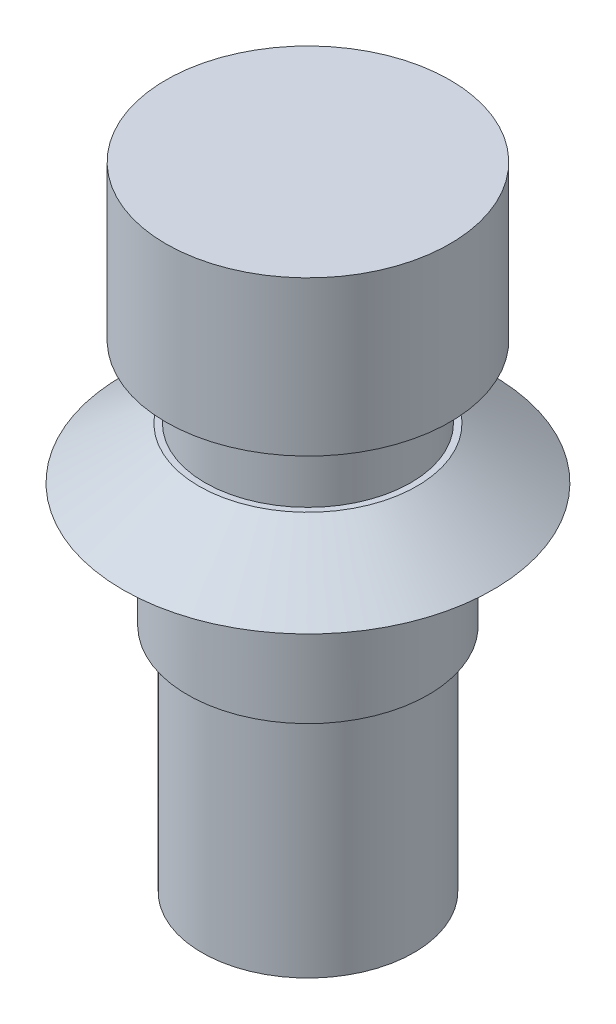
ISO-10303-21;
HEADER;
FILE_DESCRIPTION(('STEP AP214'),'2;1');
FILE_NAME('part.step','',(''),(''),'','','');
FILE_SCHEMA(('AUTOMOTIVE_DESIGN { 1 0 10303 214 1 1 1 1 }'));
ENDSEC;
DATA;
#1=APPLICATION_CONTEXT('core data for automotive mechanical design processes');
#2=APPLICATION_PROTOCOL_DEFINITION('international standard','automotive_design',2000,#1);
#3=PRODUCT_CONTEXT('',#1,'mechanical');
#4=PRODUCT('Part','Part','',(#3));
#5=PRODUCT_RELATED_PRODUCT_CATEGORY('part','',(#4));
#6=PRODUCT_DEFINITION_FORMATION('','',#4);
#7=PRODUCT_DEFINITION_CONTEXT('part definition',#1,'design');
#8=PRODUCT_DEFINITION('design','',#6,#7);
#9=PRODUCT_DEFINITION_SHAPE('','',#8);
#10=(LENGTH_UNIT() NAMED_UNIT(*) SI_UNIT(.MILLI.,.METRE.));
#11=(NAMED_UNIT(*) PLANE_ANGLE_UNIT() SI_UNIT($,.RADIAN.));
#12=(NAMED_UNIT(*) SI_UNIT($,.STERADIAN.) SOLID_ANGLE_UNIT());
#13=UNCERTAINTY_MEASURE_WITH_UNIT(LENGTH_MEASURE(1.E-05),#10,'distance_accuracy_value','');
#14=(GEOMETRIC_REPRESENTATION_CONTEXT(3) GLOBAL_UNCERTAINTY_ASSIGNED_CONTEXT((#13)) GLOBAL_UNIT_ASSIGNED_CONTEXT((#10,
#11,#12)) REPRESENTATION_CONTEXT('',''));
#15=CARTESIAN_POINT('',(0.,0.,0.));
#16=DIRECTION('',(0.,0.,1.));
#17=DIRECTION('',(1.,0.,0.));
#18=AXIS2_PLACEMENT_3D('',#15,#16,#17);
#19=CARTESIAN_POINT('',(0.,17.2,0.));
#20=DIRECTION('',(0.,-1.,0.));
#21=DIRECTION('',(0.,0.,-1.));
#22=AXIS2_PLACEMENT_3D('',#19,#20,#21);
#23=CYLINDRICAL_SURFACE('',#22,5.85);
#24=CARTESIAN_POINT('',(0.,17.2,0.));
#25=DIRECTION('',(0.,1.,0.));
#26=DIRECTION('',(0.,0.,1.));
#27=AXIS2_PLACEMENT_3D('',#24,#25,#26);
#28=CIRCLE('',#27,5.85);
#29=CARTESIAN_POINT('',(0.,17.2,5.85));
#30=VERTEX_POINT('',#29);
#31=EDGE_CURVE('E11',#30,#30,#28,.T.);
#32=ORIENTED_EDGE('',*,*,#31,.F.);
#33=EDGE_LOOP('',(#32));
#34=FACE_BOUND('',#33,.T.);
#35=CARTESIAN_POINT('',(0.,11.2,0.));
#36=DIRECTION('',(0.,-1.,0.));
#37=DIRECTION('',(0.,0.,-1.));
#38=AXIS2_PLACEMENT_3D('',#35,#36,#37);
#39=CIRCLE('',#38,5.85);
#40=CARTESIAN_POINT('',(0.,11.2,-5.85));
#41=VERTEX_POINT('',#40);
#42=EDGE_CURVE('E36',#41,#41,#39,.T.);
#43=ORIENTED_EDGE('',*,*,#42,.F.);
#44=EDGE_LOOP('',(#43));
#45=FACE_BOUND('',#44,.T.);
#46=ADVANCED_FACE('F33',(#34,#45),#23,.T.);
#47=CARTESIAN_POINT('',(0.,17.2,0.));
#48=DIRECTION('',(0.,-1.,0.));
#49=DIRECTION('',(0.,0.,1.));
#50=AXIS2_PLACEMENT_3D('',#47,#48,#49);
#51=CONICAL_SURFACE('',#50,9.,0.977384381116827);
#52=CARTESIAN_POINT('',(0.,19.7,0.));
#53=DIRECTION('',(0.,1.,0.));
#54=DIRECTION('',(0.,0.,1.));
#55=AXIS2_PLACEMENT_3D('',#52,#53,#54);
#56=CIRCLE('',#55,5.29359757871813);
#57=CARTESIAN_POINT('',(0.,19.7,5.29359757871813));
#58=VERTEX_POINT('',#57);
#59=EDGE_CURVE('E40',#58,#58,#56,.T.);
#60=ORIENTED_EDGE('',*,*,#59,.F.);
#61=EDGE_LOOP('',(#60));
#62=FACE_BOUND('',#61,.T.);
#63=CARTESIAN_POINT('',(0.,17.2,0.));
#64=DIRECTION('',(0.,1.,0.));
#65=DIRECTION('',(0.,0.,1.));
#66=AXIS2_PLACEMENT_3D('',#63,#64,#65);
#67=CIRCLE('',#66,9.);
#68=CARTESIAN_POINT('',(0.,17.2,9.));
#69=VERTEX_POINT('',#68);
#70=EDGE_CURVE('E44',#69,#69,#67,.T.);
#71=ORIENTED_EDGE('',*,*,#70,.T.);
#72=EDGE_LOOP('',(#71));
#73=FACE_BOUND('',#72,.T.);
#74=ADVANCED_FACE('F74',(#62,#73),#51,.T.);
#75=CARTESIAN_POINT('',(0.,19.7,0.));
#76=DIRECTION('',(0.,1.,0.));
#77=DIRECTION('',(0.,0.,1.));
#78=AXIS2_PLACEMENT_3D('',#75,#76,#77);
#79=PLANE('',#78);
#80=CARTESIAN_POINT('',(0.,19.7,0.));
#81=DIRECTION('',(0.,1.,0.));
#82=DIRECTION('',(0.,0.,1.));
#83=AXIS2_PLACEMENT_3D('',#80,#81,#82);
#84=CIRCLE('',#83,5.);
#85=CARTESIAN_POINT('',(0.,19.7,5.));
#86=VERTEX_POINT('',#85);
#87=EDGE_CURVE('E50',#86,#86,#84,.T.);
#88=ORIENTED_EDGE('',*,*,#87,.F.);
#89=EDGE_LOOP('',(#88));
#90=FACE_BOUND('',#89,.T.);
#91=ORIENTED_EDGE('',*,*,#59,.T.);
#92=EDGE_LOOP('',(#91));
#93=FACE_BOUND('',#92,.T.);
#94=ADVANCED_FACE('F79',(#90,#93),#79,.T.);
#95=CARTESIAN_POINT('',(0.,17.2,0.));
#96=DIRECTION('',(0.,1.,0.));
#97=DIRECTION('',(0.,0.,1.));
#98=AXIS2_PLACEMENT_3D('',#95,#96,#97);
#99=PLANE('',#98);
#100=ORIENTED_EDGE('',*,*,#31,.T.);
#101=EDGE_LOOP('',(#100));
#102=FACE_BOUND('',#101,.T.);
#103=ORIENTED_EDGE('',*,*,#70,.F.);
#104=EDGE_LOOP('',(#103));
#105=FACE_BOUND('',#104,.T.);
#106=ADVANCED_FACE('F85',(#102,#105),#99,.F.);
#107=CARTESIAN_POINT('',(0.,23.2,0.));
#108=DIRECTION('',(0.,-1.,0.));
#109=DIRECTION('',(0.,0.,-1.));
#110=AXIS2_PLACEMENT_3D('',#107,#108,#109);
#111=CYLINDRICAL_SURFACE('',#110,5.);
#112=CARTESIAN_POINT('',(0.,23.2,0.));
#113=DIRECTION('',(0.,1.,0.));
#114=DIRECTION('',(0.,0.,1.));
#115=AXIS2_PLACEMENT_3D('',#112,#113,#114);
#116=CIRCLE('',#115,5.);
#117=CARTESIAN_POINT('',(0.,23.2,5.));
#118=VERTEX_POINT('',#117);
#119=EDGE_CURVE('E49',#118,#118,#116,.T.);
#120=ORIENTED_EDGE('',*,*,#119,.F.);
#121=EDGE_LOOP('',(#120));
#122=FACE_BOUND('',#121,.T.);
#123=ORIENTED_EDGE('',*,*,#87,.T.);
#124=EDGE_LOOP('',(#123));
#125=FACE_BOUND('',#124,.T.);
#126=ADVANCED_FACE('F118',(#122,#125),#111,.T.);
#127=CARTESIAN_POINT('',(0.,30.7,0.));
#128=DIRECTION('',(0.,-1.,0.));
#129=DIRECTION('',(0.,0.,-1.));
#130=AXIS2_PLACEMENT_3D('',#127,#128,#129);
#131=CYLINDRICAL_SURFACE('',#130,6.9);
#132=CARTESIAN_POINT('',(0.,30.7,0.));
#133=DIRECTION('',(0.,1.,0.));
#134=DIRECTION('',(0.,0.,1.));
#135=AXIS2_PLACEMENT_3D('',#132,#133,#134);
#136=CIRCLE('',#135,6.9);
#137=CARTESIAN_POINT('',(0.,30.7,6.9));
#138=VERTEX_POINT('',#137);
#139=EDGE_CURVE('E53',#138,#138,#136,.T.);
#140=ORIENTED_EDGE('',*,*,#139,.F.);
#141=EDGE_LOOP('',(#140));
#142=FACE_BOUND('',#141,.T.);
#143=CARTESIAN_POINT('',(0.,23.2,0.));
#144=DIRECTION('',(0.,1.,0.));
#145=DIRECTION('',(0.,0.,1.));
#146=AXIS2_PLACEMENT_3D('',#143,#144,#145);
#147=CIRCLE('',#146,6.9);
#148=CARTESIAN_POINT('',(0.,23.2,6.9));
#149=VERTEX_POINT('',#148);
#150=EDGE_CURVE('E56',#149,#149,#147,.T.);
#151=ORIENTED_EDGE('',*,*,#150,.T.);
#152=EDGE_LOOP('',(#151));
#153=FACE_BOUND('',#152,.T.);
#154=ADVANCED_FACE('F111',(#142,#153),#131,.T.);
#155=CARTESIAN_POINT('',(0.,30.7,0.));
#156=DIRECTION('',(0.,1.,0.));
#157=DIRECTION('',(0.,0.,1.));
#158=AXIS2_PLACEMENT_3D('',#155,#156,#157);
#159=PLANE('',#158);
#160=ORIENTED_EDGE('',*,*,#139,.T.);
#161=EDGE_LOOP('',(#160));
#162=FACE_BOUND('',#161,.T.);
#163=ADVANCED_FACE('F108',(#162),#159,.T.);
#164=CARTESIAN_POINT('',(0.,23.2,0.));
#165=DIRECTION('',(0.,1.,0.));
#166=DIRECTION('',(0.,0.,1.));
#167=AXIS2_PLACEMENT_3D('',#164,#165,#166);
#168=PLANE('',#167);
#169=ORIENTED_EDGE('',*,*,#119,.T.);
#170=EDGE_LOOP('',(#169));
#171=FACE_BOUND('',#170,.T.);
#172=ORIENTED_EDGE('',*,*,#150,.F.);
#173=EDGE_LOOP('',(#172));
#174=FACE_BOUND('',#173,.T.);
#175=ADVANCED_FACE('F104',(#171,#174),#168,.F.);
#176=CARTESIAN_POINT('',(0.,11.2,0.));
#177=DIRECTION('',(0.,-1.,0.));
#178=DIRECTION('',(0.,0.,-1.));
#179=AXIS2_PLACEMENT_3D('',#176,#177,#178);
#180=PLANE('',#179);
#181=CARTESIAN_POINT('',(0.,11.2,0.));
#182=DIRECTION('',(0.,-1.,0.));
#183=DIRECTION('',(0.,0.,-1.));
#184=AXIS2_PLACEMENT_3D('',#181,#182,#183);
#185=CIRCLE('',#184,5.15);
#186=CARTESIAN_POINT('',(0.,11.2,-5.15));
#187=VERTEX_POINT('',#186);
#188=EDGE_CURVE('E64',#187,#187,#185,.T.);
#189=ORIENTED_EDGE('',*,*,#188,.F.);
#190=EDGE_LOOP('',(#189));
#191=FACE_BOUND('',#190,.T.);
#192=ORIENTED_EDGE('',*,*,#42,.T.);
#193=EDGE_LOOP('',(#192));
#194=FACE_BOUND('',#193,.T.);
#195=ADVANCED_FACE('F71',(#191,#194),#180,.T.);
#196=CARTESIAN_POINT('',(0.,11.2,0.));
#197=DIRECTION('',(0.,-1.,0.));
#198=DIRECTION('',(0.,0.,-1.));
#199=AXIS2_PLACEMENT_3D('',#196,#197,#198);
#200=CYLINDRICAL_SURFACE('',#199,5.15);
#201=ORIENTED_EDGE('',*,*,#188,.T.);
#202=EDGE_LOOP('',(#201));
#203=FACE_BOUND('',#202,.T.);
#204=CARTESIAN_POINT('',(0.,0.,0.));
#205=DIRECTION('',(0.,-1.,0.));
#206=DIRECTION('',(0.,0.,-1.));
#207=AXIS2_PLACEMENT_3D('',#204,#205,#206);
#208=CIRCLE('',#207,5.15);
#209=CARTESIAN_POINT('',(0.,0.,-5.15));
#210=VERTEX_POINT('',#209);
#211=EDGE_CURVE('E61',#210,#210,#208,.T.);
#212=ORIENTED_EDGE('',*,*,#211,.F.);
#213=EDGE_LOOP('',(#212));
#214=FACE_BOUND('',#213,.T.);
#215=ADVANCED_FACE('F93',(#203,#214),#200,.T.);
#216=CARTESIAN_POINT('',(0.,0.,0.));
#217=DIRECTION('',(0.,1.,0.));
#218=DIRECTION('',(0.,0.,1.));
#219=AXIS2_PLACEMENT_3D('',#216,#217,#218);
#220=PLANE('',#219);
#221=ORIENTED_EDGE('',*,*,#211,.T.);
#222=EDGE_LOOP('',(#221));
#223=FACE_BOUND('',#222,.T.);
#224=ADVANCED_FACE('F91',(#223),#220,.F.);
#225=CLOSED_SHELL('',(#46,#74,#94,#106,#126,#154,#163,#175,#195,#215,#224));
#226=MANIFOLD_SOLID_BREP('B2',#225);
#227=ADVANCED_BREP_SHAPE_REPRESENTATION('',(#18,#226),#14);
#228=SHAPE_DEFINITION_REPRESENTATION(#9,#227);
ENDSEC;
END-ISO-10303-21;
